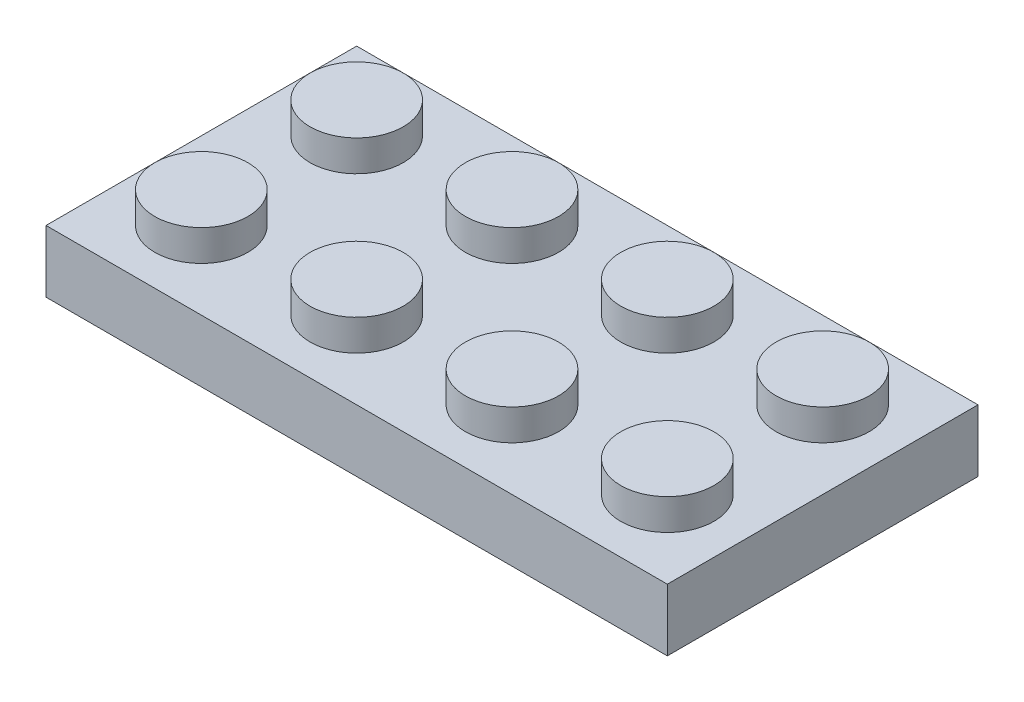
ISO-10303-21;
HEADER;
FILE_DESCRIPTION(('STEP AP214'),'2;1');
FILE_NAME('part.step','',(''),(''),'','','');
FILE_SCHEMA(('AUTOMOTIVE_DESIGN { 1 0 10303 214 1 1 1 1 }'));
ENDSEC;
DATA;
#1=APPLICATION_CONTEXT('core data for automotive mechanical design processes');
#2=APPLICATION_PROTOCOL_DEFINITION('international standard','automotive_design',2000,#1);
#3=PRODUCT_CONTEXT('',#1,'mechanical');
#4=PRODUCT('Part','Part','',(#3));
#5=PRODUCT_RELATED_PRODUCT_CATEGORY('part','',(#4));
#6=PRODUCT_DEFINITION_FORMATION('','',#4);
#7=PRODUCT_DEFINITION_CONTEXT('part definition',#1,'design');
#8=PRODUCT_DEFINITION('design','',#6,#7);
#9=PRODUCT_DEFINITION_SHAPE('','',#8);
#10=(LENGTH_UNIT() NAMED_UNIT(*) SI_UNIT(.MILLI.,.METRE.));
#11=(NAMED_UNIT(*) PLANE_ANGLE_UNIT() SI_UNIT($,.RADIAN.));
#12=(NAMED_UNIT(*) SI_UNIT($,.STERADIAN.) SOLID_ANGLE_UNIT());
#13=UNCERTAINTY_MEASURE_WITH_UNIT(LENGTH_MEASURE(1.E-05),#10,'distance_accuracy_value','');
#14=(GEOMETRIC_REPRESENTATION_CONTEXT(3) GLOBAL_UNCERTAINTY_ASSIGNED_CONTEXT((#13)) GLOBAL_UNIT_ASSIGNED_CONTEXT((#10,
#11,#12)) REPRESENTATION_CONTEXT('',''));
#15=CARTESIAN_POINT('',(0.,0.,0.));
#16=DIRECTION('',(0.,0.,1.));
#17=DIRECTION('',(1.,0.,0.));
#18=AXIS2_PLACEMENT_3D('',#15,#16,#17);
#19=CARTESIAN_POINT('',(0.,0.,0.));
#20=DIRECTION('',(0.,1.,0.));
#21=DIRECTION('',(0.,0.,1.));
#22=AXIS2_PLACEMENT_3D('',#19,#20,#21);
#23=PLANE('',#22);
#24=CARTESIAN_POINT('',(-7.5,0.,-2.5));
#25=DIRECTION('',(0.,1.,0.));
#26=DIRECTION('',(0.,0.,1.));
#27=AXIS2_PLACEMENT_3D('',#24,#25,#26);
#28=CIRCLE('',#27,0.75);
#29=CARTESIAN_POINT('',(-7.5,0.,-1.75));
#30=VERTEX_POINT('',#29);
#31=EDGE_CURVE('E226',#30,#30,#28,.T.);
#32=ORIENTED_EDGE('',*,*,#31,.T.);
#33=EDGE_LOOP('',(#32));
#34=FACE_BOUND('',#33,.T.);
#35=CARTESIAN_POINT('',(7.5,0.,-2.5));
#36=DIRECTION('',(0.,1.,0.));
#37=DIRECTION('',(0.,0.,1.));
#38=AXIS2_PLACEMENT_3D('',#35,#36,#37);
#39=CIRCLE('',#38,0.75);
#40=CARTESIAN_POINT('',(7.5,0.,-1.75));
#41=VERTEX_POINT('',#40);
#42=EDGE_CURVE('E220',#41,#41,#39,.T.);
#43=ORIENTED_EDGE('',*,*,#42,.T.);
#44=EDGE_LOOP('',(#43));
#45=FACE_BOUND('',#44,.T.);
#46=CARTESIAN_POINT('',(7.50000000000005,0.,2.5));
#47=DIRECTION('',(0.,1.,0.));
#48=DIRECTION('',(0.,0.,1.));
#49=AXIS2_PLACEMENT_3D('',#46,#47,#48);
#50=CIRCLE('',#49,0.75);
#51=CARTESIAN_POINT('',(7.50000000000005,0.,3.25));
#52=VERTEX_POINT('',#51);
#53=EDGE_CURVE('E257',#52,#52,#50,.T.);
#54=ORIENTED_EDGE('',*,*,#53,.T.);
#55=EDGE_LOOP('',(#54));
#56=FACE_BOUND('',#55,.T.);
#57=CARTESIAN_POINT('',(2.5,0.,-2.5));
#58=DIRECTION('',(0.,1.,0.));
#59=DIRECTION('',(0.,0.,1.));
#60=AXIS2_PLACEMENT_3D('',#57,#58,#59);
#61=CIRCLE('',#60,0.75);
#62=CARTESIAN_POINT('',(2.5,0.,-1.75));
#63=VERTEX_POINT('',#62);
#64=EDGE_CURVE('E251',#63,#63,#61,.T.);
#65=ORIENTED_EDGE('',*,*,#64,.T.);
#66=EDGE_LOOP('',(#65));
#67=FACE_BOUND('',#66,.T.);
#68=CARTESIAN_POINT('',(2.50000000000005,0.,2.5));
#69=DIRECTION('',(0.,1.,0.));
#70=DIRECTION('',(0.,0.,1.));
#71=AXIS2_PLACEMENT_3D('',#68,#69,#70);
#72=CIRCLE('',#71,0.75);
#73=CARTESIAN_POINT('',(2.50000000000005,0.,3.25));
#74=VERTEX_POINT('',#73);
#75=EDGE_CURVE('E245',#74,#74,#72,.T.);
#76=ORIENTED_EDGE('',*,*,#75,.T.);
#77=EDGE_LOOP('',(#76));
#78=FACE_BOUND('',#77,.T.);
#79=CARTESIAN_POINT('',(-2.5,0.,-2.5));
#80=DIRECTION('',(0.,1.,0.));
#81=DIRECTION('',(0.,0.,1.));
#82=AXIS2_PLACEMENT_3D('',#79,#80,#81);
#83=CIRCLE('',#82,0.75);
#84=CARTESIAN_POINT('',(-2.5,0.,-1.75));
#85=VERTEX_POINT('',#84);
#86=EDGE_CURVE('E239',#85,#85,#83,.T.);
#87=ORIENTED_EDGE('',*,*,#86,.T.);
#88=EDGE_LOOP('',(#87));
#89=FACE_BOUND('',#88,.T.);
#90=CARTESIAN_POINT('',(-2.49999999999995,0.,2.5));
#91=DIRECTION('',(0.,1.,0.));
#92=DIRECTION('',(0.,0.,1.));
#93=AXIS2_PLACEMENT_3D('',#90,#91,#92);
#94=CIRCLE('',#93,0.75);
#95=CARTESIAN_POINT('',(-2.49999999999995,0.,3.25));
#96=VERTEX_POINT('',#95);
#97=EDGE_CURVE('E233',#96,#96,#94,.T.);
#98=ORIENTED_EDGE('',*,*,#97,.T.);
#99=EDGE_LOOP('',(#98));
#100=FACE_BOUND('',#99,.T.);
#101=CARTESIAN_POINT('',(-7.49999999999995,0.,2.5));
#102=DIRECTION('',(0.,1.,0.));
#103=DIRECTION('',(0.,0.,1.));
#104=AXIS2_PLACEMENT_3D('',#101,#102,#103);
#105=CIRCLE('',#104,0.75);
#106=CARTESIAN_POINT('',(-7.49999999999995,0.,3.25));
#107=VERTEX_POINT('',#106);
#108=EDGE_CURVE('E227',#107,#107,#105,.T.);
#109=ORIENTED_EDGE('',*,*,#108,.T.);
#110=EDGE_LOOP('',(#109));
#111=FACE_BOUND('',#110,.T.);
#112=CARTESIAN_POINT('',(-4.99999999999995,0.,0.));
#113=DIRECTION('',(0.,1.,0.));
#114=DIRECTION('',(0.,0.,1.));
#115=AXIS2_PLACEMENT_3D('',#112,#113,#114);
#116=CIRCLE('',#115,2.03553390593272);
#117=CARTESIAN_POINT('',(-4.99999999999995,0.,2.03553390593275));
#118=VERTEX_POINT('',#117);
#119=EDGE_CURVE('E211',#118,#118,#116,.T.);
#120=ORIENTED_EDGE('',*,*,#119,.T.);
#121=EDGE_LOOP('',(#120));
#122=FACE_BOUND('',#121,.T.);
#123=CARTESIAN_POINT('',(0.,0.,0.));
#124=DIRECTION('',(0.,1.,0.));
#125=DIRECTION('',(0.,0.,1.));
#126=AXIS2_PLACEMENT_3D('',#123,#124,#125);
#127=CIRCLE('',#126,2.03553390593272);
#128=CARTESIAN_POINT('',(0.,0.,2.03553390593275));
#129=VERTEX_POINT('',#128);
#130=EDGE_CURVE('E202',#129,#129,#127,.T.);
#131=ORIENTED_EDGE('',*,*,#130,.T.);
#132=EDGE_LOOP('',(#131));
#133=FACE_BOUND('',#132,.T.);
#134=CARTESIAN_POINT('',(5.00000000000006,0.,0.));
#135=DIRECTION('',(0.,1.,0.));
#136=DIRECTION('',(0.,0.,1.));
#137=AXIS2_PLACEMENT_3D('',#134,#135,#136);
#138=CIRCLE('',#137,2.03553390593272);
#139=CARTESIAN_POINT('',(5.00000000000006,0.,2.03553390593275));
#140=VERTEX_POINT('',#139);
#141=EDGE_CURVE('E192',#140,#140,#138,.T.);
#142=ORIENTED_EDGE('',*,*,#141,.T.);
#143=EDGE_LOOP('',(#142));
#144=FACE_BOUND('',#143,.T.);
#145=DIRECTION('',(0.,0.,-1.));
#146=VECTOR('',#145,1.);
#147=CARTESIAN_POINT('',(9.00000000000001,0.,0.));
#148=LINE('',#147,#146);
#149=CARTESIAN_POINT('',(9.00000000000001,0.,4.));
#150=VERTEX_POINT('',#149);
#151=CARTESIAN_POINT('',(9.00000000000001,0.,-4.));
#152=VERTEX_POINT('',#151);
#153=EDGE_CURVE('E187',#150,#152,#148,.T.);
#154=ORIENTED_EDGE('',*,*,#153,.F.);
#155=DIRECTION('',(1.,0.,0.));
#156=VECTOR('',#155,1.);
#157=CARTESIAN_POINT('',(0.,0.,4.));
#158=LINE('',#157,#156);
#159=CARTESIAN_POINT('',(-9.,0.,4.));
#160=VERTEX_POINT('',#159);
#161=EDGE_CURVE('E161',#160,#150,#158,.T.);
#162=ORIENTED_EDGE('',*,*,#161,.F.);
#163=DIRECTION('',(0.,0.,-1.));
#164=VECTOR('',#163,1.);
#165=CARTESIAN_POINT('',(-9.,0.,0.));
#166=LINE('',#165,#164);
#167=CARTESIAN_POINT('',(-9.,0.,-4.));
#168=VERTEX_POINT('',#167);
#169=EDGE_CURVE('E100',#160,#168,#166,.T.);
#170=ORIENTED_EDGE('',*,*,#169,.T.);
#171=DIRECTION('',(1.,0.,0.));
#172=VECTOR('',#171,1.);
#173=CARTESIAN_POINT('',(0.,0.,-4.));
#174=LINE('',#173,#172);
#175=EDGE_CURVE('E95',#168,#152,#174,.T.);
#176=ORIENTED_EDGE('',*,*,#175,.T.);
#177=EDGE_LOOP('',(#154,#162,#170,#176));
#178=FACE_BOUND('',#177,.T.);
#179=ADVANCED_FACE('F80',(#34,#45,#56,#67,#78,#89,#100,#111,#122,#133,#144,#178),#23,.F.);
#180=CARTESIAN_POINT('',(-7.5,1.,-2.5));
#181=DIRECTION('',(0.,-1.,0.));
#182=DIRECTION('',(0.,0.,-1.));
#183=AXIS2_PLACEMENT_3D('',#180,#181,#182);
#184=CYLINDRICAL_SURFACE('',#183,0.75);
#185=CARTESIAN_POINT('',(-7.5,1.,-2.5));
#186=DIRECTION('',(0.,1.,0.));
#187=DIRECTION('',(0.,0.,1.));
#188=AXIS2_PLACEMENT_3D('',#185,#186,#187);
#189=CIRCLE('',#188,0.75);
#190=CARTESIAN_POINT('',(-7.5,1.,-1.75));
#191=VERTEX_POINT('',#190);
#192=EDGE_CURVE('E265',#191,#191,#189,.T.);
#193=ORIENTED_EDGE('',*,*,#192,.T.);
#194=EDGE_LOOP('',(#193));
#195=FACE_BOUND('',#194,.T.);
#196=ORIENTED_EDGE('',*,*,#31,.F.);
#197=EDGE_LOOP('',(#196));
#198=FACE_BOUND('',#197,.T.);
#199=ADVANCED_FACE('F370',(#195,#198),#184,.F.);
#200=CARTESIAN_POINT('',(0.,1.,0.));
#201=DIRECTION('',(0.,1.,0.));
#202=DIRECTION('',(0.,0.,1.));
#203=AXIS2_PLACEMENT_3D('',#200,#201,#202);
#204=PLANE('',#203);
#205=ORIENTED_EDGE('',*,*,#192,.F.);
#206=EDGE_LOOP('',(#205));
#207=FACE_BOUND('',#206,.T.);
#208=ADVANCED_FACE('F377',(#207),#204,.F.);
#209=CARTESIAN_POINT('',(7.5,1.,-2.5));
#210=DIRECTION('',(0.,-1.,0.));
#211=DIRECTION('',(0.,0.,-1.));
#212=AXIS2_PLACEMENT_3D('',#209,#210,#211);
#213=CYLINDRICAL_SURFACE('',#212,0.75);
#214=CARTESIAN_POINT('',(7.5,1.,-2.5));
#215=DIRECTION('',(0.,1.,0.));
#216=DIRECTION('',(0.,0.,1.));
#217=AXIS2_PLACEMENT_3D('',#214,#215,#216);
#218=CIRCLE('',#217,0.75);
#219=CARTESIAN_POINT('',(7.5,1.,-1.75));
#220=VERTEX_POINT('',#219);
#221=EDGE_CURVE('E260',#220,#220,#218,.T.);
#222=ORIENTED_EDGE('',*,*,#221,.T.);
#223=EDGE_LOOP('',(#222));
#224=FACE_BOUND('',#223,.T.);
#225=ORIENTED_EDGE('',*,*,#42,.F.);
#226=EDGE_LOOP('',(#225));
#227=FACE_BOUND('',#226,.T.);
#228=ADVANCED_FACE('F491',(#224,#227),#213,.F.);
#229=CARTESIAN_POINT('',(0.,1.,0.));
#230=DIRECTION('',(0.,1.,0.));
#231=DIRECTION('',(0.,0.,1.));
#232=AXIS2_PLACEMENT_3D('',#229,#230,#231);
#233=PLANE('',#232);
#234=ORIENTED_EDGE('',*,*,#221,.F.);
#235=EDGE_LOOP('',(#234));
#236=FACE_BOUND('',#235,.T.);
#237=ADVANCED_FACE('F487',(#236),#233,.F.);
#238=CARTESIAN_POINT('',(7.50000000000005,1.,2.5));
#239=DIRECTION('',(0.,-1.,0.));
#240=DIRECTION('',(0.,0.,-1.));
#241=AXIS2_PLACEMENT_3D('',#238,#239,#240);
#242=CYLINDRICAL_SURFACE('',#241,0.75);
#243=CARTESIAN_POINT('',(7.50000000000005,1.,2.5));
#244=DIRECTION('',(0.,1.,0.));
#245=DIRECTION('',(0.,0.,1.));
#246=AXIS2_PLACEMENT_3D('',#243,#244,#245);
#247=CIRCLE('',#246,0.75);
#248=CARTESIAN_POINT('',(7.50000000000005,1.,3.25));
#249=VERTEX_POINT('',#248);
#250=EDGE_CURVE('E254',#249,#249,#247,.T.);
#251=ORIENTED_EDGE('',*,*,#250,.T.);
#252=EDGE_LOOP('',(#251));
#253=FACE_BOUND('',#252,.T.);
#254=ORIENTED_EDGE('',*,*,#53,.F.);
#255=EDGE_LOOP('',(#254));
#256=FACE_BOUND('',#255,.T.);
#257=ADVANCED_FACE('F483',(#253,#256),#242,.F.);
#258=CARTESIAN_POINT('',(0.,1.,0.));
#259=DIRECTION('',(0.,1.,0.));
#260=DIRECTION('',(0.,0.,1.));
#261=AXIS2_PLACEMENT_3D('',#258,#259,#260);
#262=PLANE('',#261);
#263=ORIENTED_EDGE('',*,*,#250,.F.);
#264=EDGE_LOOP('',(#263));
#265=FACE_BOUND('',#264,.T.);
#266=ADVANCED_FACE('F479',(#265),#262,.F.);
#267=CARTESIAN_POINT('',(2.5,1.,-2.5));
#268=DIRECTION('',(0.,-1.,0.));
#269=DIRECTION('',(0.,0.,-1.));
#270=AXIS2_PLACEMENT_3D('',#267,#268,#269);
#271=CYLINDRICAL_SURFACE('',#270,0.75);
#272=CARTESIAN_POINT('',(2.5,1.,-2.5));
#273=DIRECTION('',(0.,1.,0.));
#274=DIRECTION('',(0.,0.,1.));
#275=AXIS2_PLACEMENT_3D('',#272,#273,#274);
#276=CIRCLE('',#275,0.75);
#277=CARTESIAN_POINT('',(2.5,1.,-1.75));
#278=VERTEX_POINT('',#277);
#279=EDGE_CURVE('E248',#278,#278,#276,.T.);
#280=ORIENTED_EDGE('',*,*,#279,.T.);
#281=EDGE_LOOP('',(#280));
#282=FACE_BOUND('',#281,.T.);
#283=ORIENTED_EDGE('',*,*,#64,.F.);
#284=EDGE_LOOP('',(#283));
#285=FACE_BOUND('',#284,.T.);
#286=ADVANCED_FACE('F475',(#282,#285),#271,.F.);
#287=CARTESIAN_POINT('',(0.,1.,0.));
#288=DIRECTION('',(0.,1.,0.));
#289=DIRECTION('',(0.,0.,1.));
#290=AXIS2_PLACEMENT_3D('',#287,#288,#289);
#291=PLANE('',#290);
#292=ORIENTED_EDGE('',*,*,#279,.F.);
#293=EDGE_LOOP('',(#292));
#294=FACE_BOUND('',#293,.T.);
#295=ADVANCED_FACE('F471',(#294),#291,.F.);
#296=CARTESIAN_POINT('',(2.50000000000005,1.,2.5));
#297=DIRECTION('',(0.,-1.,0.));
#298=DIRECTION('',(0.,0.,-1.));
#299=AXIS2_PLACEMENT_3D('',#296,#297,#298);
#300=CYLINDRICAL_SURFACE('',#299,0.75);
#301=CARTESIAN_POINT('',(2.50000000000005,1.,2.5));
#302=DIRECTION('',(0.,1.,0.));
#303=DIRECTION('',(0.,0.,1.));
#304=AXIS2_PLACEMENT_3D('',#301,#302,#303);
#305=CIRCLE('',#304,0.75);
#306=CARTESIAN_POINT('',(2.50000000000005,1.,3.25));
#307=VERTEX_POINT('',#306);
#308=EDGE_CURVE('E242',#307,#307,#305,.T.);
#309=ORIENTED_EDGE('',*,*,#308,.T.);
#310=EDGE_LOOP('',(#309));
#311=FACE_BOUND('',#310,.T.);
#312=ORIENTED_EDGE('',*,*,#75,.F.);
#313=EDGE_LOOP('',(#312));
#314=FACE_BOUND('',#313,.T.);
#315=ADVANCED_FACE('F467',(#311,#314),#300,.F.);
#316=CARTESIAN_POINT('',(0.,1.,0.));
#317=DIRECTION('',(0.,1.,0.));
#318=DIRECTION('',(0.,0.,1.));
#319=AXIS2_PLACEMENT_3D('',#316,#317,#318);
#320=PLANE('',#319);
#321=ORIENTED_EDGE('',*,*,#308,.F.);
#322=EDGE_LOOP('',(#321));
#323=FACE_BOUND('',#322,.T.);
#324=ADVANCED_FACE('F463',(#323),#320,.F.);
#325=CARTESIAN_POINT('',(-2.5,1.,-2.5));
#326=DIRECTION('',(0.,-1.,0.));
#327=DIRECTION('',(0.,0.,-1.));
#328=AXIS2_PLACEMENT_3D('',#325,#326,#327);
#329=CYLINDRICAL_SURFACE('',#328,0.75);
#330=CARTESIAN_POINT('',(-2.5,1.,-2.5));
#331=DIRECTION('',(0.,1.,0.));
#332=DIRECTION('',(0.,0.,1.));
#333=AXIS2_PLACEMENT_3D('',#330,#331,#332);
#334=CIRCLE('',#333,0.75);
#335=CARTESIAN_POINT('',(-2.5,1.,-1.75));
#336=VERTEX_POINT('',#335);
#337=EDGE_CURVE('E236',#336,#336,#334,.T.);
#338=ORIENTED_EDGE('',*,*,#337,.T.);
#339=EDGE_LOOP('',(#338));
#340=FACE_BOUND('',#339,.T.);
#341=ORIENTED_EDGE('',*,*,#86,.F.);
#342=EDGE_LOOP('',(#341));
#343=FACE_BOUND('',#342,.T.);
#344=ADVANCED_FACE('F459',(#340,#343),#329,.F.);
#345=CARTESIAN_POINT('',(0.,1.,0.));
#346=DIRECTION('',(0.,1.,0.));
#347=DIRECTION('',(0.,0.,1.));
#348=AXIS2_PLACEMENT_3D('',#345,#346,#347);
#349=PLANE('',#348);
#350=ORIENTED_EDGE('',*,*,#337,.F.);
#351=EDGE_LOOP('',(#350));
#352=FACE_BOUND('',#351,.T.);
#353=ADVANCED_FACE('F455',(#352),#349,.F.);
#354=CARTESIAN_POINT('',(-2.49999999999995,1.,2.5));
#355=DIRECTION('',(0.,-1.,0.));
#356=DIRECTION('',(0.,0.,-1.));
#357=AXIS2_PLACEMENT_3D('',#354,#355,#356);
#358=CYLINDRICAL_SURFACE('',#357,0.75);
#359=CARTESIAN_POINT('',(-2.49999999999995,1.,2.5));
#360=DIRECTION('',(0.,1.,0.));
#361=DIRECTION('',(0.,0.,1.));
#362=AXIS2_PLACEMENT_3D('',#359,#360,#361);
#363=CIRCLE('',#362,0.75);
#364=CARTESIAN_POINT('',(-2.49999999999995,1.,3.25));
#365=VERTEX_POINT('',#364);
#366=EDGE_CURVE('E230',#365,#365,#363,.T.);
#367=ORIENTED_EDGE('',*,*,#366,.T.);
#368=EDGE_LOOP('',(#367));
#369=FACE_BOUND('',#368,.T.);
#370=ORIENTED_EDGE('',*,*,#97,.F.);
#371=EDGE_LOOP('',(#370));
#372=FACE_BOUND('',#371,.T.);
#373=ADVANCED_FACE('F451',(#369,#372),#358,.F.);
#374=CARTESIAN_POINT('',(0.,1.,0.));
#375=DIRECTION('',(0.,1.,0.));
#376=DIRECTION('',(0.,0.,1.));
#377=AXIS2_PLACEMENT_3D('',#374,#375,#376);
#378=PLANE('',#377);
#379=ORIENTED_EDGE('',*,*,#366,.F.);
#380=EDGE_LOOP('',(#379));
#381=FACE_BOUND('',#380,.T.);
#382=ADVANCED_FACE('F447',(#381),#378,.F.);
#383=CARTESIAN_POINT('',(-7.49999999999995,1.,2.5));
#384=DIRECTION('',(0.,-1.,0.));
#385=DIRECTION('',(0.,0.,-1.));
#386=AXIS2_PLACEMENT_3D('',#383,#384,#385);
#387=CYLINDRICAL_SURFACE('',#386,0.75);
#388=CARTESIAN_POINT('',(-7.49999999999995,1.,2.5));
#389=DIRECTION('',(0.,1.,0.));
#390=DIRECTION('',(0.,0.,1.));
#391=AXIS2_PLACEMENT_3D('',#388,#389,#390);
#392=CIRCLE('',#391,0.75);
#393=CARTESIAN_POINT('',(-7.49999999999995,1.,3.25));
#394=VERTEX_POINT('',#393);
#395=EDGE_CURVE('E223',#394,#394,#392,.T.);
#396=ORIENTED_EDGE('',*,*,#395,.T.);
#397=EDGE_LOOP('',(#396));
#398=FACE_BOUND('',#397,.T.);
#399=ORIENTED_EDGE('',*,*,#108,.F.);
#400=EDGE_LOOP('',(#399));
#401=FACE_BOUND('',#400,.T.);
#402=ADVANCED_FACE('F443',(#398,#401),#387,.F.);
#403=CARTESIAN_POINT('',(0.,1.,0.));
#404=DIRECTION('',(0.,1.,0.));
#405=DIRECTION('',(0.,0.,1.));
#406=AXIS2_PLACEMENT_3D('',#403,#404,#405);
#407=PLANE('',#406);
#408=ORIENTED_EDGE('',*,*,#395,.F.);
#409=EDGE_LOOP('',(#408));
#410=FACE_BOUND('',#409,.T.);
#411=ADVANCED_FACE('F439',(#410),#407,.F.);
#412=CARTESIAN_POINT('',(-4.99999999999995,-1.,0.));
#413=DIRECTION('',(0.,1.,0.));
#414=DIRECTION('',(0.,0.,1.));
#415=AXIS2_PLACEMENT_3D('',#412,#413,#414);
#416=CYLINDRICAL_SURFACE('',#415,1.5);
#417=CARTESIAN_POINT('',(-4.99999999999995,-1.,0.));
#418=DIRECTION('',(0.,1.,0.));
#419=DIRECTION('',(0.,0.,1.));
#420=AXIS2_PLACEMENT_3D('',#417,#418,#419);
#421=CIRCLE('',#420,1.5);
#422=CARTESIAN_POINT('',(-4.99999999999995,-1.,1.50000000000003));
#423=VERTEX_POINT('',#422);
#424=EDGE_CURVE('E214',#423,#423,#421,.T.);
#425=ORIENTED_EDGE('',*,*,#424,.F.);
#426=EDGE_LOOP('',(#425));
#427=FACE_BOUND('',#426,.T.);
#428=CARTESIAN_POINT('',(-4.99999999999995,0.,0.));
#429=DIRECTION('',(0.,1.,0.));
#430=DIRECTION('',(0.,0.,1.));
#431=AXIS2_PLACEMENT_3D('',#428,#429,#430);
#432=CIRCLE('',#431,1.5);
#433=CARTESIAN_POINT('',(-4.99999999999995,0.,1.50000000000003));
#434=VERTEX_POINT('',#433);
#435=EDGE_CURVE('E335',#434,#434,#432,.T.);
#436=ORIENTED_EDGE('',*,*,#435,.T.);
#437=EDGE_LOOP('',(#436));
#438=FACE_BOUND('',#437,.T.);
#439=ADVANCED_FACE('F435',(#427,#438),#416,.F.);
#440=CARTESIAN_POINT('',(-4.99999999999995,-1.,0.));
#441=DIRECTION('',(0.,1.,0.));
#442=DIRECTION('',(0.,0.,1.));
#443=AXIS2_PLACEMENT_3D('',#440,#441,#442);
#444=CYLINDRICAL_SURFACE('',#443,2.03553390593272);
#445=CARTESIAN_POINT('',(-4.99999999999995,-1.,0.));
#446=DIRECTION('',(0.,1.,0.));
#447=DIRECTION('',(0.,0.,1.));
#448=AXIS2_PLACEMENT_3D('',#445,#446,#447);
#449=CIRCLE('',#448,2.03553390593272);
#450=CARTESIAN_POINT('',(-4.99999999999995,-1.,2.03553390593275));
#451=VERTEX_POINT('',#450);
#452=EDGE_CURVE('E217',#451,#451,#449,.T.);
#453=ORIENTED_EDGE('',*,*,#452,.T.);
#454=EDGE_LOOP('',(#453));
#455=FACE_BOUND('',#454,.T.);
#456=ORIENTED_EDGE('',*,*,#119,.F.);
#457=EDGE_LOOP('',(#456));
#458=FACE_BOUND('',#457,.T.);
#459=ADVANCED_FACE('F431',(#455,#458),#444,.T.);
#460=CARTESIAN_POINT('',(0.,-1.,0.));
#461=DIRECTION('',(0.,1.,0.));
#462=DIRECTION('',(0.,0.,1.));
#463=AXIS2_PLACEMENT_3D('',#460,#461,#462);
#464=PLANE('',#463);
#465=ORIENTED_EDGE('',*,*,#424,.T.);
#466=EDGE_LOOP('',(#465));
#467=FACE_BOUND('',#466,.T.);
#468=ORIENTED_EDGE('',*,*,#452,.F.);
#469=EDGE_LOOP('',(#468));
#470=FACE_BOUND('',#469,.T.);
#471=ADVANCED_FACE('F364',(#467,#470),#464,.F.);
#472=ORIENTED_EDGE('',*,*,#435,.F.);
#473=EDGE_LOOP('',(#472));
#474=FACE_BOUND('',#473,.T.);
#475=ADVANCED_FACE('F348',(#474),#23,.F.);
#476=CARTESIAN_POINT('',(0.,-1.,0.));
#477=DIRECTION('',(0.,1.,0.));
#478=DIRECTION('',(0.,0.,1.));
#479=AXIS2_PLACEMENT_3D('',#476,#477,#478);
#480=CYLINDRICAL_SURFACE('',#479,1.5);
#481=CARTESIAN_POINT('',(0.,-1.,0.));
#482=DIRECTION('',(0.,1.,0.));
#483=DIRECTION('',(0.,0.,1.));
#484=AXIS2_PLACEMENT_3D('',#481,#482,#483);
#485=CIRCLE('',#484,1.5);
#486=CARTESIAN_POINT('',(0.,-1.,1.50000000000003));
#487=VERTEX_POINT('',#486);
#488=EDGE_CURVE('E205',#487,#487,#485,.T.);
#489=ORIENTED_EDGE('',*,*,#488,.F.);
#490=EDGE_LOOP('',(#489));
#491=FACE_BOUND('',#490,.T.);
#492=CARTESIAN_POINT('',(0.,0.,0.));
#493=DIRECTION('',(0.,1.,0.));
#494=DIRECTION('',(0.,0.,1.));
#495=AXIS2_PLACEMENT_3D('',#492,#493,#494);
#496=CIRCLE('',#495,1.5);
#497=CARTESIAN_POINT('',(0.,0.,1.50000000000003));
#498=VERTEX_POINT('',#497);
#499=EDGE_CURVE('E88',#498,#498,#496,.T.);
#500=ORIENTED_EDGE('',*,*,#499,.T.);
#501=EDGE_LOOP('',(#500));
#502=FACE_BOUND('',#501,.T.);
#503=ADVANCED_FACE('F342',(#491,#502),#480,.F.);
#504=CARTESIAN_POINT('',(0.,-1.,0.));
#505=DIRECTION('',(0.,1.,0.));
#506=DIRECTION('',(0.,0.,1.));
#507=AXIS2_PLACEMENT_3D('',#504,#505,#506);
#508=CYLINDRICAL_SURFACE('',#507,2.03553390593272);
#509=CARTESIAN_POINT('',(0.,-1.,0.));
#510=DIRECTION('',(0.,1.,0.));
#511=DIRECTION('',(0.,0.,1.));
#512=AXIS2_PLACEMENT_3D('',#509,#510,#511);
#513=CIRCLE('',#512,2.03553390593272);
#514=CARTESIAN_POINT('',(0.,-1.,2.03553390593275));
#515=VERTEX_POINT('',#514);
#516=EDGE_CURVE('E208',#515,#515,#513,.T.);
#517=ORIENTED_EDGE('',*,*,#516,.T.);
#518=EDGE_LOOP('',(#517));
#519=FACE_BOUND('',#518,.T.);
#520=ORIENTED_EDGE('',*,*,#130,.F.);
#521=EDGE_LOOP('',(#520));
#522=FACE_BOUND('',#521,.T.);
#523=ADVANCED_FACE('F359',(#519,#522),#508,.T.);
#524=CARTESIAN_POINT('',(0.,-1.,0.));
#525=DIRECTION('',(0.,1.,0.));
#526=DIRECTION('',(0.,0.,1.));
#527=AXIS2_PLACEMENT_3D('',#524,#525,#526);
#528=PLANE('',#527);
#529=ORIENTED_EDGE('',*,*,#488,.T.);
#530=EDGE_LOOP('',(#529));
#531=FACE_BOUND('',#530,.T.);
#532=ORIENTED_EDGE('',*,*,#516,.F.);
#533=EDGE_LOOP('',(#532));
#534=FACE_BOUND('',#533,.T.);
#535=ADVANCED_FACE('F347',(#531,#534),#528,.F.);
#536=ORIENTED_EDGE('',*,*,#499,.F.);
#537=EDGE_LOOP('',(#536));
#538=FACE_BOUND('',#537,.T.);
#539=ADVANCED_FACE('F344',(#538),#23,.F.);
#540=CARTESIAN_POINT('',(5.00000000000006,-1.,0.));
#541=DIRECTION('',(0.,1.,0.));
#542=DIRECTION('',(0.,0.,1.));
#543=AXIS2_PLACEMENT_3D('',#540,#541,#542);
#544=CYLINDRICAL_SURFACE('',#543,1.5);
#545=CARTESIAN_POINT('',(5.00000000000006,-1.,0.));
#546=DIRECTION('',(0.,1.,0.));
#547=DIRECTION('',(0.,0.,1.));
#548=AXIS2_PLACEMENT_3D('',#545,#546,#547);
#549=CIRCLE('',#548,1.5);
#550=CARTESIAN_POINT('',(5.00000000000006,-1.,1.50000000000003));
#551=VERTEX_POINT('',#550);
#552=EDGE_CURVE('E196',#551,#551,#549,.T.);
#553=ORIENTED_EDGE('',*,*,#552,.F.);
#554=EDGE_LOOP('',(#553));
#555=FACE_BOUND('',#554,.T.);
#556=CARTESIAN_POINT('',(5.00000000000006,0.,0.));
#557=DIRECTION('',(0.,1.,0.));
#558=DIRECTION('',(0.,0.,1.));
#559=AXIS2_PLACEMENT_3D('',#556,#557,#558);
#560=CIRCLE('',#559,1.5);
#561=CARTESIAN_POINT('',(5.00000000000006,0.,1.50000000000003));
#562=VERTEX_POINT('',#561);
#563=EDGE_CURVE('E12',#562,#562,#560,.T.);
#564=ORIENTED_EDGE('',*,*,#563,.T.);
#565=EDGE_LOOP('',(#564));
#566=FACE_BOUND('',#565,.T.);
#567=ADVANCED_FACE('F346',(#555,#566),#544,.F.);
#568=CARTESIAN_POINT('',(5.00000000000006,-1.,0.));
#569=DIRECTION('',(0.,1.,0.));
#570=DIRECTION('',(0.,0.,1.));
#571=AXIS2_PLACEMENT_3D('',#568,#569,#570);
#572=CYLINDRICAL_SURFACE('',#571,2.03553390593272);
#573=CARTESIAN_POINT('',(5.00000000000006,-1.,0.));
#574=DIRECTION('',(0.,1.,0.));
#575=DIRECTION('',(0.,0.,1.));
#576=AXIS2_PLACEMENT_3D('',#573,#574,#575);
#577=CIRCLE('',#576,2.03553390593272);
#578=CARTESIAN_POINT('',(5.00000000000006,-1.,2.03553390593275));
#579=VERTEX_POINT('',#578);
#580=EDGE_CURVE('E199',#579,#579,#577,.T.);
#581=ORIENTED_EDGE('',*,*,#580,.T.);
#582=EDGE_LOOP('',(#581));
#583=FACE_BOUND('',#582,.T.);
#584=ORIENTED_EDGE('',*,*,#141,.F.);
#585=EDGE_LOOP('',(#584));
#586=FACE_BOUND('',#585,.T.);
#587=ADVANCED_FACE('F355',(#583,#586),#572,.T.);
#588=CARTESIAN_POINT('',(0.,-1.,0.));
#589=DIRECTION('',(0.,1.,0.));
#590=DIRECTION('',(0.,0.,1.));
#591=AXIS2_PLACEMENT_3D('',#588,#589,#590);
#592=PLANE('',#591);
#593=ORIENTED_EDGE('',*,*,#552,.T.);
#594=EDGE_LOOP('',(#593));
#595=FACE_BOUND('',#594,.T.);
#596=ORIENTED_EDGE('',*,*,#580,.F.);
#597=EDGE_LOOP('',(#596));
#598=FACE_BOUND('',#597,.T.);
#599=ADVANCED_FACE('F367',(#595,#598),#592,.F.);
#600=ORIENTED_EDGE('',*,*,#563,.F.);
#601=EDGE_LOOP('',(#600));
#602=FACE_BOUND('',#601,.T.);
#603=ADVANCED_FACE('F349',(#602),#23,.F.);
#604=CARTESIAN_POINT('',(9.00000000000001,-1.,0.));
#605=DIRECTION('',(1.,0.,0.));
#606=DIRECTION('',(0.,0.,-1.));
#607=AXIS2_PLACEMENT_3D('',#604,#605,#606);
#608=PLANE('',#607);
#609=ORIENTED_EDGE('',*,*,#153,.T.);
#610=DIRECTION('',(0.,1.,0.));
#611=VECTOR('',#610,1.);
#612=CARTESIAN_POINT('',(9.00000000000001,-1.,-4.));
#613=LINE('',#612,#611);
#614=CARTESIAN_POINT('',(9.00000000000001,-1.,-4.));
#615=VERTEX_POINT('',#614);
#616=EDGE_CURVE('E168',#615,#152,#613,.T.);
#617=ORIENTED_EDGE('',*,*,#616,.F.);
#618=DIRECTION('',(0.,0.,-1.));
#619=VECTOR('',#618,1.);
#620=CARTESIAN_POINT('',(9.00000000000001,-1.,0.));
#621=LINE('',#620,#619);
#622=CARTESIAN_POINT('',(9.00000000000001,-1.,4.));
#623=VERTEX_POINT('',#622);
#624=EDGE_CURVE('E150',#623,#615,#621,.T.);
#625=ORIENTED_EDGE('',*,*,#624,.F.);
#626=DIRECTION('',(0.,1.,0.));
#627=VECTOR('',#626,1.);
#628=CARTESIAN_POINT('',(9.00000000000001,-1.,4.));
#629=LINE('',#628,#627);
#630=EDGE_CURVE('E159',#623,#150,#629,.T.);
#631=ORIENTED_EDGE('',*,*,#630,.T.);
#632=EDGE_LOOP('',(#609,#617,#625,#631));
#633=FACE_BOUND('',#632,.T.);
#634=ADVANCED_FACE('F167',(#633),#608,.F.);
#635=CARTESIAN_POINT('',(0.,-1.,-4.));
#636=DIRECTION('',(0.,0.,1.));
#637=DIRECTION('',(1.,0.,0.));
#638=AXIS2_PLACEMENT_3D('',#635,#636,#637);
#639=PLANE('',#638);
#640=ORIENTED_EDGE('',*,*,#175,.F.);
#641=DIRECTION('',(0.,1.,0.));
#642=VECTOR('',#641,1.);
#643=CARTESIAN_POINT('',(-9.,-1.,-4.));
#644=LINE('',#643,#642);
#645=CARTESIAN_POINT('',(-9.,-1.,-4.));
#646=VERTEX_POINT('',#645);
#647=EDGE_CURVE('E193',#646,#168,#644,.T.);
#648=ORIENTED_EDGE('',*,*,#647,.F.);
#649=DIRECTION('',(1.,0.,0.));
#650=VECTOR('',#649,1.);
#651=CARTESIAN_POINT('',(0.,-1.,-4.));
#652=LINE('',#651,#650);
#653=EDGE_CURVE('E174',#646,#615,#652,.T.);
#654=ORIENTED_EDGE('',*,*,#653,.T.);
#655=ORIENTED_EDGE('',*,*,#616,.T.);
#656=EDGE_LOOP('',(#640,#648,#654,#655));
#657=FACE_BOUND('',#656,.T.);
#658=ADVANCED_FACE('F404',(#657),#639,.T.);
#659=CARTESIAN_POINT('',(-9.,-1.,0.));
#660=DIRECTION('',(1.,0.,0.));
#661=DIRECTION('',(0.,0.,-1.));
#662=AXIS2_PLACEMENT_3D('',#659,#660,#661);
#663=PLANE('',#662);
#664=ORIENTED_EDGE('',*,*,#169,.F.);
#665=DIRECTION('',(0.,1.,0.));
#666=VECTOR('',#665,1.);
#667=CARTESIAN_POINT('',(-9.,-1.,4.));
#668=LINE('',#667,#666);
#669=CARTESIAN_POINT('',(-9.,-1.,4.));
#670=VERTEX_POINT('',#669);
#671=EDGE_CURVE('E164',#670,#160,#668,.T.);
#672=ORIENTED_EDGE('',*,*,#671,.F.);
#673=DIRECTION('',(0.,0.,-1.));
#674=VECTOR('',#673,1.);
#675=CARTESIAN_POINT('',(-9.,-1.,0.));
#676=LINE('',#675,#674);
#677=EDGE_CURVE('E153',#670,#646,#676,.T.);
#678=ORIENTED_EDGE('',*,*,#677,.T.);
#679=ORIENTED_EDGE('',*,*,#647,.T.);
#680=EDGE_LOOP('',(#664,#672,#678,#679));
#681=FACE_BOUND('',#680,.T.);
#682=ADVANCED_FACE('F402',(#681),#663,.T.);
#683=CARTESIAN_POINT('',(0.,-1.,4.));
#684=DIRECTION('',(0.,0.,1.));
#685=DIRECTION('',(1.,0.,0.));
#686=AXIS2_PLACEMENT_3D('',#683,#684,#685);
#687=PLANE('',#686);
#688=ORIENTED_EDGE('',*,*,#161,.T.);
#689=ORIENTED_EDGE('',*,*,#630,.F.);
#690=DIRECTION('',(1.,0.,0.));
#691=VECTOR('',#690,1.);
#692=CARTESIAN_POINT('',(0.,-1.,4.));
#693=LINE('',#692,#691);
#694=EDGE_CURVE('E144',#670,#623,#693,.T.);
#695=ORIENTED_EDGE('',*,*,#694,.F.);
#696=ORIENTED_EDGE('',*,*,#671,.T.);
#697=EDGE_LOOP('',(#688,#689,#695,#696));
#698=FACE_BOUND('',#697,.T.);
#699=ADVANCED_FACE('F160',(#698),#687,.F.);
#700=CARTESIAN_POINT('',(0.,-1.,0.));
#701=DIRECTION('',(0.,1.,0.));
#702=DIRECTION('',(0.,0.,1.));
#703=AXIS2_PLACEMENT_3D('',#700,#701,#702);
#704=PLANE('',#703);
#705=ORIENTED_EDGE('',*,*,#624,.T.);
#706=ORIENTED_EDGE('',*,*,#653,.F.);
#707=ORIENTED_EDGE('',*,*,#677,.F.);
#708=ORIENTED_EDGE('',*,*,#694,.T.);
#709=EDGE_LOOP('',(#705,#706,#707,#708));
#710=FACE_BOUND('',#709,.T.);
#711=DIRECTION('',(1.,0.,0.));
#712=VECTOR('',#711,1.);
#713=CARTESIAN_POINT('',(0.,-1.,5.));
#714=LINE('',#713,#712);
#715=CARTESIAN_POINT('',(-10.,-1.,5.));
#716=VERTEX_POINT('',#715);
#717=CARTESIAN_POINT('',(10.,-1.,5.));
#718=VERTEX_POINT('',#717);
#719=EDGE_CURVE('E176',#716,#718,#714,.T.);
#720=ORIENTED_EDGE('',*,*,#719,.F.);
#721=DIRECTION('',(0.,0.,-1.));
#722=VECTOR('',#721,1.);
#723=CARTESIAN_POINT('',(-10.,-1.,0.));
#724=LINE('',#723,#722);
#725=CARTESIAN_POINT('',(-10.,-1.,-5.));
#726=VERTEX_POINT('',#725);
#727=EDGE_CURVE('E165',#716,#726,#724,.T.);
#728=ORIENTED_EDGE('',*,*,#727,.T.);
#729=DIRECTION('',(1.,0.,0.));
#730=VECTOR('',#729,1.);
#731=CARTESIAN_POINT('',(0.,-1.,-5.));
#732=LINE('',#731,#730);
#733=CARTESIAN_POINT('',(10.,-1.,-5.));
#734=VERTEX_POINT('',#733);
#735=EDGE_CURVE('E182',#726,#734,#732,.T.);
#736=ORIENTED_EDGE('',*,*,#735,.T.);
#737=DIRECTION('',(0.,0.,-1.));
#738=VECTOR('',#737,1.);
#739=CARTESIAN_POINT('',(10.,-1.,0.));
#740=LINE('',#739,#738);
#741=EDGE_CURVE('E179',#718,#734,#740,.T.);
#742=ORIENTED_EDGE('',*,*,#741,.F.);
#743=EDGE_LOOP('',(#720,#728,#736,#742));
#744=FACE_BOUND('',#743,.T.);
#745=ADVANCED_FACE('F146',(#710,#744),#704,.F.);
#746=CARTESIAN_POINT('',(0.,2.,0.));
#747=DIRECTION('',(0.,1.,0.));
#748=DIRECTION('',(0.,0.,1.));
#749=AXIS2_PLACEMENT_3D('',#746,#747,#748);
#750=PLANE('',#749);
#751=CARTESIAN_POINT('',(-7.5,2.,-2.5));
#752=DIRECTION('',(0.,1.,0.));
#753=DIRECTION('',(0.,0.,1.));
#754=AXIS2_PLACEMENT_3D('',#751,#752,#753);
#755=CIRCLE('',#754,1.5);
#756=CARTESIAN_POINT('',(-7.5,2.,-1.));
#757=VERTEX_POINT('',#756);
#758=EDGE_CURVE('E332',#757,#757,#755,.T.);
#759=ORIENTED_EDGE('',*,*,#758,.T.);
#760=EDGE_LOOP('',(#759));
#761=FACE_BOUND('',#760,.T.);
#762=ADVANCED_FACE('F552',(#761),#750,.T.);
#763=CARTESIAN_POINT('',(0.,2.,0.));
#764=DIRECTION('',(0.,1.,0.));
#765=DIRECTION('',(0.,0.,1.));
#766=AXIS2_PLACEMENT_3D('',#763,#764,#765);
#767=PLANE('',#766);
#768=CARTESIAN_POINT('',(-2.5,2.,-2.5));
#769=DIRECTION('',(0.,1.,0.));
#770=DIRECTION('',(0.,0.,1.));
#771=AXIS2_PLACEMENT_3D('',#768,#769,#770);
#772=CIRCLE('',#771,1.5);
#773=CARTESIAN_POINT('',(-2.5,2.,-1.));
#774=VERTEX_POINT('',#773);
#775=EDGE_CURVE('E306',#774,#774,#772,.T.);
#776=ORIENTED_EDGE('',*,*,#775,.T.);
#777=EDGE_LOOP('',(#776));
#778=FACE_BOUND('',#777,.T.);
#779=ADVANCED_FACE('F544',(#778),#767,.T.);
#780=CARTESIAN_POINT('',(0.,2.,0.));
#781=DIRECTION('',(0.,1.,0.));
#782=DIRECTION('',(0.,0.,1.));
#783=AXIS2_PLACEMENT_3D('',#780,#781,#782);
#784=PLANE('',#783);
#785=CARTESIAN_POINT('',(2.5,2.,-2.5));
#786=DIRECTION('',(0.,1.,0.));
#787=DIRECTION('',(0.,0.,1.));
#788=AXIS2_PLACEMENT_3D('',#785,#786,#787);
#789=CIRCLE('',#788,1.5);
#790=CARTESIAN_POINT('',(2.5,2.,-1.));
#791=VERTEX_POINT('',#790);
#792=EDGE_CURVE('E300',#791,#791,#789,.T.);
#793=ORIENTED_EDGE('',*,*,#792,.T.);
#794=EDGE_LOOP('',(#793));
#795=FACE_BOUND('',#794,.T.);
#796=ADVANCED_FACE('F536',(#795),#784,.T.);
#797=CARTESIAN_POINT('',(0.,2.,0.));
#798=DIRECTION('',(0.,1.,0.));
#799=DIRECTION('',(0.,0.,1.));
#800=AXIS2_PLACEMENT_3D('',#797,#798,#799);
#801=PLANE('',#800);
#802=CARTESIAN_POINT('',(7.5,2.,-2.5));
#803=DIRECTION('',(0.,1.,0.));
#804=DIRECTION('',(0.,0.,1.));
#805=AXIS2_PLACEMENT_3D('',#802,#803,#804);
#806=CIRCLE('',#805,1.5);
#807=CARTESIAN_POINT('',(7.5,2.,-1.));
#808=VERTEX_POINT('',#807);
#809=EDGE_CURVE('E294',#808,#808,#806,.T.);
#810=ORIENTED_EDGE('',*,*,#809,.T.);
#811=EDGE_LOOP('',(#810));
#812=FACE_BOUND('',#811,.T.);
#813=ADVANCED_FACE('F528',(#812),#801,.T.);
#814=CARTESIAN_POINT('',(0.,2.,0.));
#815=DIRECTION('',(0.,1.,0.));
#816=DIRECTION('',(0.,0.,1.));
#817=AXIS2_PLACEMENT_3D('',#814,#815,#816);
#818=PLANE('',#817);
#819=CARTESIAN_POINT('',(7.50000000000005,2.,2.5));
#820=DIRECTION('',(0.,1.,0.));
#821=DIRECTION('',(0.,0.,1.));
#822=AXIS2_PLACEMENT_3D('',#819,#820,#821);
#823=CIRCLE('',#822,1.5);
#824=CARTESIAN_POINT('',(7.50000000000005,2.,4.));
#825=VERTEX_POINT('',#824);
#826=EDGE_CURVE('E288',#825,#825,#823,.T.);
#827=ORIENTED_EDGE('',*,*,#826,.T.);
#828=EDGE_LOOP('',(#827));
#829=FACE_BOUND('',#828,.T.);
#830=ADVANCED_FACE('F520',(#829),#818,.T.);
#831=CARTESIAN_POINT('',(0.,2.,0.));
#832=DIRECTION('',(0.,1.,0.));
#833=DIRECTION('',(0.,0.,1.));
#834=AXIS2_PLACEMENT_3D('',#831,#832,#833);
#835=PLANE('',#834);
#836=CARTESIAN_POINT('',(2.50000000000005,2.,2.5));
#837=DIRECTION('',(0.,1.,0.));
#838=DIRECTION('',(0.,0.,1.));
#839=AXIS2_PLACEMENT_3D('',#836,#837,#838);
#840=CIRCLE('',#839,1.5);
#841=CARTESIAN_POINT('',(2.50000000000005,2.,4.));
#842=VERTEX_POINT('',#841);
#843=EDGE_CURVE('E282',#842,#842,#840,.T.);
#844=ORIENTED_EDGE('',*,*,#843,.T.);
#845=EDGE_LOOP('',(#844));
#846=FACE_BOUND('',#845,.T.);
#847=ADVANCED_FACE('F512',(#846),#835,.T.);
#848=CARTESIAN_POINT('',(0.,2.,0.));
#849=DIRECTION('',(0.,1.,0.));
#850=DIRECTION('',(0.,0.,1.));
#851=AXIS2_PLACEMENT_3D('',#848,#849,#850);
#852=PLANE('',#851);
#853=CARTESIAN_POINT('',(-2.49999999999995,2.,2.5));
#854=DIRECTION('',(0.,1.,0.));
#855=DIRECTION('',(0.,0.,1.));
#856=AXIS2_PLACEMENT_3D('',#853,#854,#855);
#857=CIRCLE('',#856,1.5);
#858=CARTESIAN_POINT('',(-2.49999999999995,2.,4.));
#859=VERTEX_POINT('',#858);
#860=EDGE_CURVE('E276',#859,#859,#857,.T.);
#861=ORIENTED_EDGE('',*,*,#860,.T.);
#862=EDGE_LOOP('',(#861));
#863=FACE_BOUND('',#862,.T.);
#864=ADVANCED_FACE('F502',(#863),#852,.T.);
#865=CARTESIAN_POINT('',(0.,2.,0.));
#866=DIRECTION('',(0.,1.,0.));
#867=DIRECTION('',(0.,0.,1.));
#868=AXIS2_PLACEMENT_3D('',#865,#866,#867);
#869=PLANE('',#868);
#870=CARTESIAN_POINT('',(-7.49999999999995,2.,2.5));
#871=DIRECTION('',(0.,1.,0.));
#872=DIRECTION('',(0.,0.,1.));
#873=AXIS2_PLACEMENT_3D('',#870,#871,#872);
#874=CIRCLE('',#873,1.5);
#875=CARTESIAN_POINT('',(-7.49999999999995,2.,4.));
#876=VERTEX_POINT('',#875);
#877=EDGE_CURVE('E268',#876,#876,#874,.T.);
#878=ORIENTED_EDGE('',*,*,#877,.T.);
#879=EDGE_LOOP('',(#878));
#880=FACE_BOUND('',#879,.T.);
#881=ADVANCED_FACE('F499',(#880),#869,.T.);
#882=CARTESIAN_POINT('',(-7.5,2.,-2.5));
#883=DIRECTION('',(0.,-1.,0.));
#884=DIRECTION('',(0.,0.,-1.));
#885=AXIS2_PLACEMENT_3D('',#882,#883,#884);
#886=CYLINDRICAL_SURFACE('',#885,1.5);
#887=CARTESIAN_POINT('',(-7.5,1.,-2.5));
#888=DIRECTION('',(0.,1.,0.));
#889=DIRECTION('',(0.,0.,1.));
#890=AXIS2_PLACEMENT_3D('',#887,#888,#889);
#891=CIRCLE('',#890,1.5);
#892=CARTESIAN_POINT('',(-7.5,1.,-1.));
#893=VERTEX_POINT('',#892);
#894=EDGE_CURVE('E331',#893,#893,#891,.T.);
#895=ORIENTED_EDGE('',*,*,#894,.T.);
#896=EDGE_LOOP('',(#895));
#897=FACE_BOUND('',#896,.T.);
#898=ORIENTED_EDGE('',*,*,#758,.F.);
#899=EDGE_LOOP('',(#898));
#900=FACE_BOUND('',#899,.T.);
#901=ADVANCED_FACE('F82',(#897,#900),#886,.T.);
#902=CARTESIAN_POINT('',(-2.5,2.,-2.5));
#903=DIRECTION('',(0.,-1.,0.));
#904=DIRECTION('',(0.,0.,-1.));
#905=AXIS2_PLACEMENT_3D('',#902,#903,#904);
#906=CYLINDRICAL_SURFACE('',#905,1.5);
#907=CARTESIAN_POINT('',(-2.5,1.,-2.5));
#908=DIRECTION('',(0.,1.,0.));
#909=DIRECTION('',(0.,0.,1.));
#910=AXIS2_PLACEMENT_3D('',#907,#908,#909);
#911=CIRCLE('',#910,1.5);
#912=CARTESIAN_POINT('',(-2.5,1.,-1.));
#913=VERTEX_POINT('',#912);
#914=EDGE_CURVE('E309',#913,#913,#911,.F.);
#915=ORIENTED_EDGE('',*,*,#914,.F.);
#916=EDGE_LOOP('',(#915));
#917=FACE_BOUND('',#916,.T.);
#918=ORIENTED_EDGE('',*,*,#775,.F.);
#919=EDGE_LOOP('',(#918));
#920=FACE_BOUND('',#919,.T.);
#921=ADVANCED_FACE('F548',(#917,#920),#906,.T.);
#922=CARTESIAN_POINT('',(2.5,2.,-2.5));
#923=DIRECTION('',(0.,-1.,0.));
#924=DIRECTION('',(0.,0.,-1.));
#925=AXIS2_PLACEMENT_3D('',#922,#923,#924);
#926=CYLINDRICAL_SURFACE('',#925,1.5);
#927=CARTESIAN_POINT('',(2.5,1.,-2.5));
#928=DIRECTION('',(0.,1.,0.));
#929=DIRECTION('',(0.,0.,1.));
#930=AXIS2_PLACEMENT_3D('',#927,#928,#929);
#931=CIRCLE('',#930,1.5);
#932=CARTESIAN_POINT('',(2.5,1.,-1.));
#933=VERTEX_POINT('',#932);
#934=EDGE_CURVE('E303',#933,#933,#931,.F.);
#935=ORIENTED_EDGE('',*,*,#934,.F.);
#936=EDGE_LOOP('',(#935));
#937=FACE_BOUND('',#936,.T.);
#938=ORIENTED_EDGE('',*,*,#792,.F.);
#939=EDGE_LOOP('',(#938));
#940=FACE_BOUND('',#939,.T.);
#941=ADVANCED_FACE('F540',(#937,#940),#926,.T.);
#942=CARTESIAN_POINT('',(7.5,2.,-2.5));
#943=DIRECTION('',(0.,-1.,0.));
#944=DIRECTION('',(0.,0.,-1.));
#945=AXIS2_PLACEMENT_3D('',#942,#943,#944);
#946=CYLINDRICAL_SURFACE('',#945,1.5);
#947=CARTESIAN_POINT('',(7.5,1.,-2.5));
#948=DIRECTION('',(0.,1.,0.));
#949=DIRECTION('',(0.,0.,1.));
#950=AXIS2_PLACEMENT_3D('',#947,#948,#949);
#951=CIRCLE('',#950,1.5);
#952=CARTESIAN_POINT('',(7.5,1.,-1.));
#953=VERTEX_POINT('',#952);
#954=EDGE_CURVE('E297',#953,#953,#951,.F.);
#955=ORIENTED_EDGE('',*,*,#954,.F.);
#956=EDGE_LOOP('',(#955));
#957=FACE_BOUND('',#956,.T.);
#958=ORIENTED_EDGE('',*,*,#809,.F.);
#959=EDGE_LOOP('',(#958));
#960=FACE_BOUND('',#959,.T.);
#961=ADVANCED_FACE('F532',(#957,#960),#946,.T.);
#962=CARTESIAN_POINT('',(7.50000000000005,2.,2.5));
#963=DIRECTION('',(0.,-1.,0.));
#964=DIRECTION('',(0.,0.,-1.));
#965=AXIS2_PLACEMENT_3D('',#962,#963,#964);
#966=CYLINDRICAL_SURFACE('',#965,1.5);
#967=CARTESIAN_POINT('',(7.50000000000005,1.,2.5));
#968=DIRECTION('',(0.,1.,0.));
#969=DIRECTION('',(0.,0.,1.));
#970=AXIS2_PLACEMENT_3D('',#967,#968,#969);
#971=CIRCLE('',#970,1.5);
#972=CARTESIAN_POINT('',(7.50000000000005,1.,4.));
#973=VERTEX_POINT('',#972);
#974=EDGE_CURVE('E291',#973,#973,#971,.F.);
#975=ORIENTED_EDGE('',*,*,#974,.F.);
#976=EDGE_LOOP('',(#975));
#977=FACE_BOUND('',#976,.T.);
#978=ORIENTED_EDGE('',*,*,#826,.F.);
#979=EDGE_LOOP('',(#978));
#980=FACE_BOUND('',#979,.T.);
#981=ADVANCED_FACE('F524',(#977,#980),#966,.T.);
#982=CARTESIAN_POINT('',(2.50000000000005,2.,2.5));
#983=DIRECTION('',(0.,-1.,0.));
#984=DIRECTION('',(0.,0.,-1.));
#985=AXIS2_PLACEMENT_3D('',#982,#983,#984);
#986=CYLINDRICAL_SURFACE('',#985,1.5);
#987=CARTESIAN_POINT('',(2.50000000000005,1.,2.5));
#988=DIRECTION('',(0.,1.,0.));
#989=DIRECTION('',(0.,0.,1.));
#990=AXIS2_PLACEMENT_3D('',#987,#988,#989);
#991=CIRCLE('',#990,1.5);
#992=CARTESIAN_POINT('',(2.50000000000005,1.,4.));
#993=VERTEX_POINT('',#992);
#994=EDGE_CURVE('E285',#993,#993,#991,.F.);
#995=ORIENTED_EDGE('',*,*,#994,.F.);
#996=EDGE_LOOP('',(#995));
#997=FACE_BOUND('',#996,.T.);
#998=ORIENTED_EDGE('',*,*,#843,.F.);
#999=EDGE_LOOP('',(#998));
#1000=FACE_BOUND('',#999,.T.);
#1001=ADVANCED_FACE('F516',(#997,#1000),#986,.T.);
#1002=CARTESIAN_POINT('',(-2.49999999999995,2.,2.5));
#1003=DIRECTION('',(0.,-1.,0.));
#1004=DIRECTION('',(0.,0.,-1.));
#1005=AXIS2_PLACEMENT_3D('',#1002,#1003,#1004);
#1006=CYLINDRICAL_SURFACE('',#1005,1.5);
#1007=CARTESIAN_POINT('',(-2.49999999999995,1.,2.5));
#1008=DIRECTION('',(0.,1.,0.));
#1009=DIRECTION('',(0.,0.,1.));
#1010=AXIS2_PLACEMENT_3D('',#1007,#1008,#1009);
#1011=CIRCLE('',#1010,1.5);
#1012=CARTESIAN_POINT('',(-2.49999999999995,1.,4.));
#1013=VERTEX_POINT('',#1012);
#1014=EDGE_CURVE('E279',#1013,#1013,#1011,.F.);
#1015=ORIENTED_EDGE('',*,*,#1014,.F.);
#1016=EDGE_LOOP('',(#1015));
#1017=FACE_BOUND('',#1016,.T.);
#1018=ORIENTED_EDGE('',*,*,#860,.F.);
#1019=EDGE_LOOP('',(#1018));
#1020=FACE_BOUND('',#1019,.T.);
#1021=ADVANCED_FACE('F508',(#1017,#1020),#1006,.T.);
#1022=CARTESIAN_POINT('',(-7.49999999999995,2.,2.5));
#1023=DIRECTION('',(0.,-1.,0.));
#1024=DIRECTION('',(0.,0.,-1.));
#1025=AXIS2_PLACEMENT_3D('',#1022,#1023,#1024);
#1026=CYLINDRICAL_SURFACE('',#1025,1.5);
#1027=CARTESIAN_POINT('',(-7.49999999999995,1.,2.5));
#1028=DIRECTION('',(0.,1.,0.));
#1029=DIRECTION('',(0.,0.,1.));
#1030=AXIS2_PLACEMENT_3D('',#1027,#1028,#1029);
#1031=CIRCLE('',#1030,1.5);
#1032=CARTESIAN_POINT('',(-7.49999999999995,1.,4.));
#1033=VERTEX_POINT('',#1032);
#1034=EDGE_CURVE('E273',#1033,#1033,#1031,.F.);
#1035=ORIENTED_EDGE('',*,*,#1034,.F.);
#1036=EDGE_LOOP('',(#1035));
#1037=FACE_BOUND('',#1036,.T.);
#1038=ORIENTED_EDGE('',*,*,#877,.F.);
#1039=EDGE_LOOP('',(#1038));
#1040=FACE_BOUND('',#1039,.T.);
#1041=ADVANCED_FACE('F504',(#1037,#1040),#1026,.T.);
#1042=CARTESIAN_POINT('',(0.,1.,0.));
#1043=DIRECTION('',(0.,1.,0.));
#1044=DIRECTION('',(0.,0.,1.));
#1045=AXIS2_PLACEMENT_3D('',#1042,#1043,#1044);
#1046=PLANE('',#1045);
#1047=ORIENTED_EDGE('',*,*,#1034,.T.);
#1048=EDGE_LOOP('',(#1047));
#1049=FACE_BOUND('',#1048,.T.);
#1050=ORIENTED_EDGE('',*,*,#1014,.T.);
#1051=EDGE_LOOP('',(#1050));
#1052=FACE_BOUND('',#1051,.T.);
#1053=ORIENTED_EDGE('',*,*,#994,.T.);
#1054=EDGE_LOOP('',(#1053));
#1055=FACE_BOUND('',#1054,.T.);
#1056=ORIENTED_EDGE('',*,*,#974,.T.);
#1057=EDGE_LOOP('',(#1056));
#1058=FACE_BOUND('',#1057,.T.);
#1059=ORIENTED_EDGE('',*,*,#954,.T.);
#1060=EDGE_LOOP('',(#1059));
#1061=FACE_BOUND('',#1060,.T.);
#1062=ORIENTED_EDGE('',*,*,#934,.T.);
#1063=EDGE_LOOP('',(#1062));
#1064=FACE_BOUND('',#1063,.T.);
#1065=ORIENTED_EDGE('',*,*,#914,.T.);
#1066=EDGE_LOOP('',(#1065));
#1067=FACE_BOUND('',#1066,.T.);
#1068=ORIENTED_EDGE('',*,*,#894,.F.);
#1069=EDGE_LOOP('',(#1068));
#1070=FACE_BOUND('',#1069,.T.);
#1071=DIRECTION('',(1.,0.,0.));
#1072=VECTOR('',#1071,1.);
#1073=CARTESIAN_POINT('',(-10.,1.,5.));
#1074=LINE('',#1073,#1072);
#1075=CARTESIAN_POINT('',(-10.,1.,5.));
#1076=VERTEX_POINT('',#1075);
#1077=CARTESIAN_POINT('',(10.,1.,5.));
#1078=VERTEX_POINT('',#1077);
#1079=EDGE_CURVE('E312',#1076,#1078,#1074,.T.);
#1080=ORIENTED_EDGE('',*,*,#1079,.T.);
#1081=DIRECTION('',(0.,0.,-1.));
#1082=VECTOR('',#1081,1.);
#1083=CARTESIAN_POINT('',(10.,1.,5.));
#1084=LINE('',#1083,#1082);
#1085=CARTESIAN_POINT('',(10.,1.,-5.));
#1086=VERTEX_POINT('',#1085);
#1087=EDGE_CURVE('E315',#1078,#1086,#1084,.T.);
#1088=ORIENTED_EDGE('',*,*,#1087,.T.);
#1089=DIRECTION('',(1.,0.,0.));
#1090=VECTOR('',#1089,1.);
#1091=CARTESIAN_POINT('',(-10.,1.,-5.));
#1092=LINE('',#1091,#1090);
#1093=CARTESIAN_POINT('',(-10.,1.,-5.));
#1094=VERTEX_POINT('',#1093);
#1095=EDGE_CURVE('E317',#1094,#1086,#1092,.T.);
#1096=ORIENTED_EDGE('',*,*,#1095,.F.);
#1097=DIRECTION('',(0.,0.,-1.));
#1098=VECTOR('',#1097,1.);
#1099=CARTESIAN_POINT('',(-10.,1.,5.));
#1100=LINE('',#1099,#1098);
#1101=EDGE_CURVE('E320',#1076,#1094,#1100,.T.);
#1102=ORIENTED_EDGE('',*,*,#1101,.F.);
#1103=EDGE_LOOP('',(#1080,#1088,#1096,#1102));
#1104=FACE_BOUND('',#1103,.T.);
#1105=ADVANCED_FACE('F507',(#1049,#1052,#1055,#1058,#1061,#1064,#1067,#1070,#1104),#1046,.T.);
#1106=CARTESIAN_POINT('',(10.,1.,5.));
#1107=DIRECTION('',(-1.,0.,0.));
#1108=DIRECTION('',(0.,0.,1.));
#1109=AXIS2_PLACEMENT_3D('',#1106,#1107,#1108);
#1110=PLANE('',#1109);
#1111=DIRECTION('',(0.,-1.,0.));
#1112=VECTOR('',#1111,1.);
#1113=CARTESIAN_POINT('',(10.,1.,5.));
#1114=LINE('',#1113,#1112);
#1115=EDGE_CURVE('E329',#1078,#718,#1114,.T.);
#1116=ORIENTED_EDGE('',*,*,#1115,.T.);
#1117=ORIENTED_EDGE('',*,*,#741,.T.);
#1118=DIRECTION('',(0.,-1.,0.));
#1119=VECTOR('',#1118,1.);
#1120=CARTESIAN_POINT('',(10.,1.,-5.));
#1121=LINE('',#1120,#1119);
#1122=EDGE_CURVE('E327',#1086,#734,#1121,.T.);
#1123=ORIENTED_EDGE('',*,*,#1122,.F.);
#1124=ORIENTED_EDGE('',*,*,#1087,.F.);
#1125=EDGE_LOOP('',(#1116,#1117,#1123,#1124));
#1126=FACE_BOUND('',#1125,.T.);
#1127=ADVANCED_FACE('F559',(#1126),#1110,.F.);
#1128=CARTESIAN_POINT('',(-10.,1.,-5.));
#1129=DIRECTION('',(0.,0.,-1.));
#1130=DIRECTION('',(-1.,0.,0.));
#1131=AXIS2_PLACEMENT_3D('',#1128,#1129,#1130);
#1132=PLANE('',#1131);
#1133=ORIENTED_EDGE('',*,*,#1122,.T.);
#1134=ORIENTED_EDGE('',*,*,#735,.F.);
#1135=DIRECTION('',(0.,-1.,0.));
#1136=VECTOR('',#1135,1.);
#1137=CARTESIAN_POINT('',(-10.,1.,-5.));
#1138=LINE('',#1137,#1136);
#1139=EDGE_CURVE('E325',#1094,#726,#1138,.T.);
#1140=ORIENTED_EDGE('',*,*,#1139,.F.);
#1141=ORIENTED_EDGE('',*,*,#1095,.T.);
#1142=EDGE_LOOP('',(#1133,#1134,#1140,#1141));
#1143=FACE_BOUND('',#1142,.T.);
#1144=ADVANCED_FACE('F565',(#1143),#1132,.T.);
#1145=CARTESIAN_POINT('',(-10.,1.,5.));
#1146=DIRECTION('',(-1.,0.,0.));
#1147=DIRECTION('',(0.,0.,1.));
#1148=AXIS2_PLACEMENT_3D('',#1145,#1146,#1147);
#1149=PLANE('',#1148);
#1150=ORIENTED_EDGE('',*,*,#1139,.T.);
#1151=ORIENTED_EDGE('',*,*,#727,.F.);
#1152=DIRECTION('',(0.,-1.,0.));
#1153=VECTOR('',#1152,1.);
#1154=CARTESIAN_POINT('',(-10.,1.,5.));
#1155=LINE('',#1154,#1153);
#1156=EDGE_CURVE('E323',#1076,#716,#1155,.T.);
#1157=ORIENTED_EDGE('',*,*,#1156,.F.);
#1158=ORIENTED_EDGE('',*,*,#1101,.T.);
#1159=EDGE_LOOP('',(#1150,#1151,#1157,#1158));
#1160=FACE_BOUND('',#1159,.T.);
#1161=ADVANCED_FACE('F561',(#1160),#1149,.T.);
#1162=CARTESIAN_POINT('',(-10.,1.,5.));
#1163=DIRECTION('',(0.,0.,-1.));
#1164=DIRECTION('',(-1.,0.,0.));
#1165=AXIS2_PLACEMENT_3D('',#1162,#1163,#1164);
#1166=PLANE('',#1165);
#1167=ORIENTED_EDGE('',*,*,#1156,.T.);
#1168=ORIENTED_EDGE('',*,*,#719,.T.);
#1169=ORIENTED_EDGE('',*,*,#1115,.F.);
#1170=ORIENTED_EDGE('',*,*,#1079,.F.);
#1171=EDGE_LOOP('',(#1167,#1168,#1169,#1170));
#1172=FACE_BOUND('',#1171,.T.);
#1173=ADVANCED_FACE('F564',(#1172),#1166,.F.);
#1174=CLOSED_SHELL('',(#179,#199,#208,#228,#237,#257,#266,#286,#295,#315,#324,#344,#353,#373,
#382,#402,#411,#439,#459,#471,#475,#503,#523,#535,#539,#567,#587,#599,#603,#634,#658,#682,#699,
#745,#762,#779,#796,#813,#830,#847,#864,#881,#901,#921,#941,#961,#981,#1001,#1021,#1041,#1105,
#1127,#1144,#1161,#1173));
#1175=MANIFOLD_SOLID_BREP('B2',#1174);
#1176=ADVANCED_BREP_SHAPE_REPRESENTATION('',(#18,#1175),#14);
#1177=SHAPE_DEFINITION_REPRESENTATION(#9,#1176);
ENDSEC;
END-ISO-10303-21;
